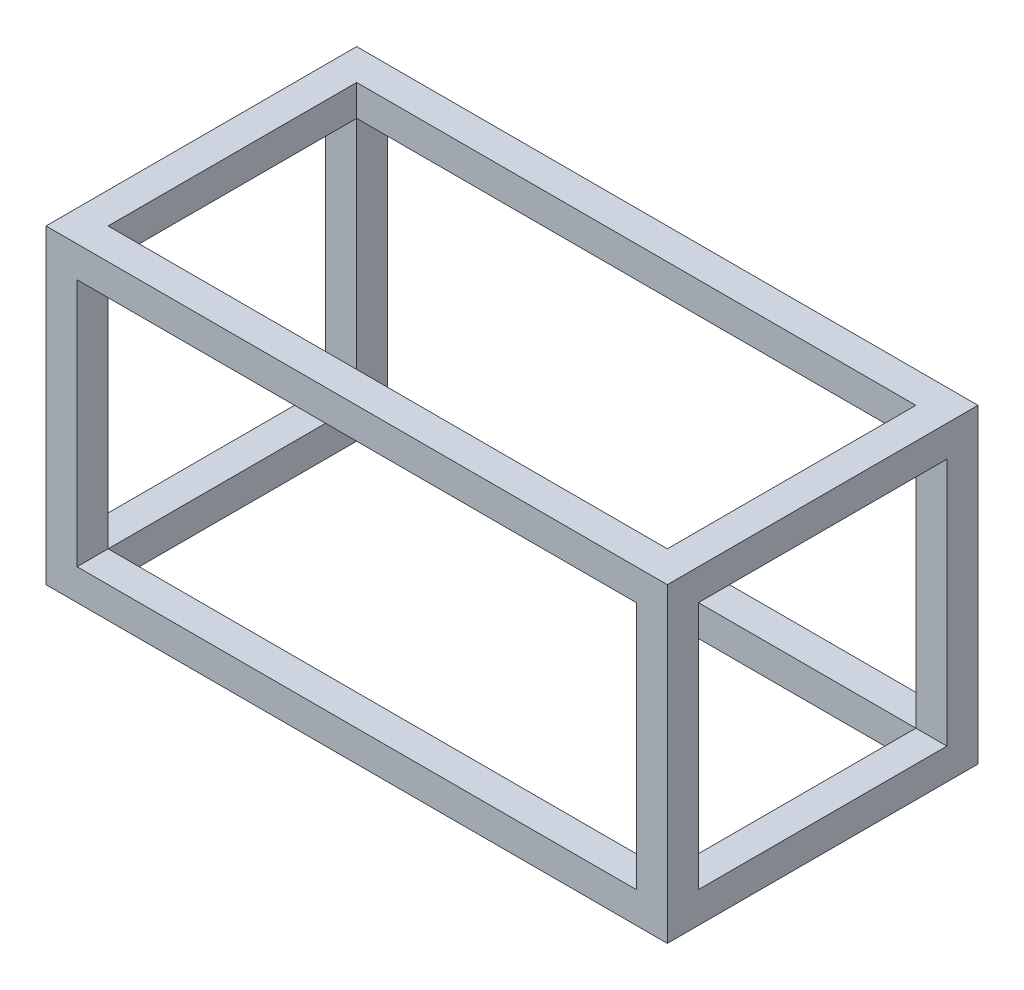
ISO-10303-21;
HEADER;
FILE_DESCRIPTION(('STEP AP214'),'2;1');
FILE_NAME('part.step','',(''),(''),'','','');
FILE_SCHEMA(('AUTOMOTIVE_DESIGN { 1 0 10303 214 1 1 1 1 }'));
ENDSEC;
DATA;
#1=APPLICATION_CONTEXT('core data for automotive mechanical design processes');
#2=APPLICATION_PROTOCOL_DEFINITION('international standard','automotive_design',2000,#1);
#3=PRODUCT_CONTEXT('',#1,'mechanical');
#4=PRODUCT('Part','Part','',(#3));
#5=PRODUCT_RELATED_PRODUCT_CATEGORY('part','',(#4));
#6=PRODUCT_DEFINITION_FORMATION('','',#4);
#7=PRODUCT_DEFINITION_CONTEXT('part definition',#1,'design');
#8=PRODUCT_DEFINITION('design','',#6,#7);
#9=PRODUCT_DEFINITION_SHAPE('','',#8);
#10=(LENGTH_UNIT() NAMED_UNIT(*) SI_UNIT(.MILLI.,.METRE.));
#11=(NAMED_UNIT(*) PLANE_ANGLE_UNIT() SI_UNIT($,.RADIAN.));
#12=(NAMED_UNIT(*) SI_UNIT($,.STERADIAN.) SOLID_ANGLE_UNIT());
#13=UNCERTAINTY_MEASURE_WITH_UNIT(LENGTH_MEASURE(1.E-05),#10,'distance_accuracy_value','');
#14=(GEOMETRIC_REPRESENTATION_CONTEXT(3) GLOBAL_UNCERTAINTY_ASSIGNED_CONTEXT((#13)) GLOBAL_UNIT_ASSIGNED_CONTEXT((#10,
#11,#12)) REPRESENTATION_CONTEXT('',''));
#15=CARTESIAN_POINT('',(0.,0.,0.));
#16=DIRECTION('',(0.,0.,1.));
#17=DIRECTION('',(1.,0.,0.));
#18=AXIS2_PLACEMENT_3D('',#15,#16,#17);
#19=CARTESIAN_POINT('',(5.00000000000001,50.,-5.));
#20=DIRECTION('',(0.,0.,-1.));
#21=DIRECTION('',(-1.,0.,0.));
#22=AXIS2_PLACEMENT_3D('',#19,#20,#21);
#23=PLANE('',#22);
#24=DIRECTION('',(-1.,0.,0.));
#25=VECTOR('',#24,1.);
#26=CARTESIAN_POINT('',(5.00000000000001,5.,-5.));
#27=LINE('',#26,#25);
#28=CARTESIAN_POINT('',(95.,5.,-5.));
#29=VERTEX_POINT('',#28);
#30=CARTESIAN_POINT('',(5.00000000000001,5.,-5.));
#31=VERTEX_POINT('',#30);
#32=EDGE_CURVE('E255',#29,#31,#27,.T.);
#33=ORIENTED_EDGE('',*,*,#32,.F.);
#34=DIRECTION('',(0.,-1.,0.));
#35=VECTOR('',#34,1.);
#36=CARTESIAN_POINT('',(95.,50.,-5.));
#37=LINE('',#36,#35);
#38=CARTESIAN_POINT('',(95.,0.,-5.));
#39=VERTEX_POINT('',#38);
#40=EDGE_CURVE('E363',#29,#39,#37,.T.);
#41=ORIENTED_EDGE('',*,*,#40,.T.);
#42=DIRECTION('',(1.,0.,0.));
#43=VECTOR('',#42,1.);
#44=CARTESIAN_POINT('',(5.00000000000001,0.,-5.));
#45=LINE('',#44,#43);
#46=CARTESIAN_POINT('',(5.00000000000001,0.,-5.));
#47=VERTEX_POINT('',#46);
#48=EDGE_CURVE('E343',#47,#39,#45,.T.);
#49=ORIENTED_EDGE('',*,*,#48,.F.);
#50=DIRECTION('',(0.,-1.,0.));
#51=VECTOR('',#50,1.);
#52=CARTESIAN_POINT('',(5.00000000000001,50.,-5.));
#53=LINE('',#52,#51);
#54=EDGE_CURVE('E368',#31,#47,#53,.T.);
#55=ORIENTED_EDGE('',*,*,#54,.F.);
#56=EDGE_LOOP('',(#33,#41,#49,#55));
#57=FACE_BOUND('',#56,.T.);
#58=ADVANCED_FACE('F43',(#57),#23,.T.);
#59=CARTESIAN_POINT('',(95.,50.,-5.));
#60=VERTEX_POINT('',#59);
#61=CARTESIAN_POINT('',(94.9999999999999,45.,-5.));
#62=VERTEX_POINT('',#61);
#63=EDGE_CURVE('E364',#60,#62,#37,.T.);
#64=ORIENTED_EDGE('',*,*,#63,.T.);
#65=DIRECTION('',(-1.,0.,0.));
#66=VECTOR('',#65,1.);
#67=CARTESIAN_POINT('',(5.00000000000001,45.,-5.));
#68=LINE('',#67,#66);
#69=CARTESIAN_POINT('',(5.,45.,-5.));
#70=VERTEX_POINT('',#69);
#71=EDGE_CURVE('E251',#62,#70,#68,.T.);
#72=ORIENTED_EDGE('',*,*,#71,.T.);
#73=CARTESIAN_POINT('',(5.00000000000001,50.,-5.));
#74=VERTEX_POINT('',#73);
#75=EDGE_CURVE('E369',#74,#70,#53,.T.);
#76=ORIENTED_EDGE('',*,*,#75,.F.);
#77=DIRECTION('',(1.,0.,0.));
#78=VECTOR('',#77,1.);
#79=CARTESIAN_POINT('',(5.00000000000001,50.,-5.));
#80=LINE('',#79,#78);
#81=EDGE_CURVE('E328',#74,#60,#80,.T.);
#82=ORIENTED_EDGE('',*,*,#81,.T.);
#83=EDGE_LOOP('',(#64,#72,#76,#82));
#84=FACE_BOUND('',#83,.T.);
#85=ADVANCED_FACE('F536',(#84),#23,.T.);
#86=DIRECTION('',(1.,0.,0.));
#87=VECTOR('',#86,1.);
#88=CARTESIAN_POINT('',(0.,5.,-5.00000000000001));
#89=LINE('',#88,#87);
#90=CARTESIAN_POINT('',(100.,5.,-5.00000000000001));
#91=VERTEX_POINT('',#90);
#92=EDGE_CURVE('E294',#29,#91,#89,.T.);
#93=ORIENTED_EDGE('',*,*,#92,.F.);
#94=DIRECTION('',(0.,1.,0.));
#95=VECTOR('',#94,1.);
#96=CARTESIAN_POINT('',(95.,50.,-5.));
#97=LINE('',#96,#95);
#98=EDGE_CURVE('E247',#29,#62,#97,.T.);
#99=ORIENTED_EDGE('',*,*,#98,.T.);
#100=DIRECTION('',(1.,0.,0.));
#101=VECTOR('',#100,1.);
#102=CARTESIAN_POINT('',(0.,45.,-5.));
#103=LINE('',#102,#101);
#104=CARTESIAN_POINT('',(100.,45.,-5.));
#105=VERTEX_POINT('',#104);
#106=EDGE_CURVE('E299',#62,#105,#103,.T.);
#107=ORIENTED_EDGE('',*,*,#106,.T.);
#108=DIRECTION('',(0.,-1.,0.));
#109=VECTOR('',#108,1.);
#110=CARTESIAN_POINT('',(100.,45.,-5.));
#111=LINE('',#110,#109);
#112=EDGE_CURVE('E264',#105,#91,#111,.T.);
#113=ORIENTED_EDGE('',*,*,#112,.T.);
#114=EDGE_LOOP('',(#93,#99,#107,#113));
#115=FACE_BOUND('',#114,.T.);
#116=ADVANCED_FACE('F495',(#115),#23,.T.);
#117=CARTESIAN_POINT('',(5.,50.,-45.));
#118=DIRECTION('',(0.,0.,1.));
#119=DIRECTION('',(1.,0.,0.));
#120=AXIS2_PLACEMENT_3D('',#117,#118,#119);
#121=PLANE('',#120);
#122=DIRECTION('',(1.,0.,0.));
#123=VECTOR('',#122,1.);
#124=CARTESIAN_POINT('',(5.,5.,-45.));
#125=LINE('',#124,#123);
#126=CARTESIAN_POINT('',(5.00000000000001,5.,-45.));
#127=VERTEX_POINT('',#126);
#128=CARTESIAN_POINT('',(94.9999999999999,5.,-45.));
#129=VERTEX_POINT('',#128);
#130=EDGE_CURVE('E11',#127,#129,#125,.T.);
#131=ORIENTED_EDGE('',*,*,#130,.F.);
#132=DIRECTION('',(0.,-1.,0.));
#133=VECTOR('',#132,1.);
#134=CARTESIAN_POINT('',(5.,50.,-45.));
#135=LINE('',#134,#133);
#136=CARTESIAN_POINT('',(5.,0.,-45.));
#137=VERTEX_POINT('',#136);
#138=EDGE_CURVE('E339',#127,#137,#135,.T.);
#139=ORIENTED_EDGE('',*,*,#138,.T.);
#140=DIRECTION('',(-1.,0.,0.));
#141=VECTOR('',#140,1.);
#142=CARTESIAN_POINT('',(5.,0.,-45.));
#143=LINE('',#142,#141);
#144=CARTESIAN_POINT('',(95.,0.,-45.));
#145=VERTEX_POINT('',#144);
#146=EDGE_CURVE('E329',#145,#137,#143,.T.);
#147=ORIENTED_EDGE('',*,*,#146,.F.);
#148=DIRECTION('',(0.,-1.,0.));
#149=VECTOR('',#148,1.);
#150=CARTESIAN_POINT('',(95.,50.,-45.));
#151=LINE('',#150,#149);
#152=EDGE_CURVE('E358',#129,#145,#151,.T.);
#153=ORIENTED_EDGE('',*,*,#152,.F.);
#154=EDGE_LOOP('',(#131,#139,#147,#153));
#155=FACE_BOUND('',#154,.T.);
#156=ADVANCED_FACE('F509',(#155),#121,.T.);
#157=CARTESIAN_POINT('',(5.,50.,-45.));
#158=VERTEX_POINT('',#157);
#159=CARTESIAN_POINT('',(5.,45.,-45.));
#160=VERTEX_POINT('',#159);
#161=EDGE_CURVE('E354',#158,#160,#135,.T.);
#162=ORIENTED_EDGE('',*,*,#161,.T.);
#163=DIRECTION('',(1.,0.,0.));
#164=VECTOR('',#163,1.);
#165=CARTESIAN_POINT('',(5.,45.,-45.));
#166=LINE('',#165,#164);
#167=CARTESIAN_POINT('',(95.,45.,-45.));
#168=VERTEX_POINT('',#167);
#169=EDGE_CURVE('E52',#160,#168,#166,.T.);
#170=ORIENTED_EDGE('',*,*,#169,.T.);
#171=CARTESIAN_POINT('',(95.,50.,-45.));
#172=VERTEX_POINT('',#171);
#173=EDGE_CURVE('E359',#172,#168,#151,.T.);
#174=ORIENTED_EDGE('',*,*,#173,.F.);
#175=DIRECTION('',(-1.,0.,0.));
#176=VECTOR('',#175,1.);
#177=CARTESIAN_POINT('',(5.,50.,-45.));
#178=LINE('',#177,#176);
#179=EDGE_CURVE('E336',#172,#158,#178,.T.);
#180=ORIENTED_EDGE('',*,*,#179,.T.);
#181=EDGE_LOOP('',(#162,#170,#174,#180));
#182=FACE_BOUND('',#181,.T.);
#183=ADVANCED_FACE('F418',(#182),#121,.T.);
#184=DIRECTION('',(1.,0.,0.));
#185=VECTOR('',#184,1.);
#186=CARTESIAN_POINT('',(0.,45.,-45.));
#187=LINE('',#186,#185);
#188=CARTESIAN_POINT('',(100.,45.,-45.));
#189=VERTEX_POINT('',#188);
#190=EDGE_CURVE('E304',#168,#189,#187,.T.);
#191=ORIENTED_EDGE('',*,*,#190,.F.);
#192=DIRECTION('',(0.,-1.,0.));
#193=VECTOR('',#192,1.);
#194=CARTESIAN_POINT('',(95.,50.,-45.));
#195=LINE('',#194,#193);
#196=EDGE_CURVE('E244',#168,#129,#195,.T.);
#197=ORIENTED_EDGE('',*,*,#196,.T.);
#198=DIRECTION('',(1.,0.,0.));
#199=VECTOR('',#198,1.);
#200=CARTESIAN_POINT('',(0.,5.,-45.));
#201=LINE('',#200,#199);
#202=CARTESIAN_POINT('',(100.,5.,-45.));
#203=VERTEX_POINT('',#202);
#204=EDGE_CURVE('E275',#129,#203,#201,.T.);
#205=ORIENTED_EDGE('',*,*,#204,.T.);
#206=DIRECTION('',(0.,-1.,0.));
#207=VECTOR('',#206,1.);
#208=CARTESIAN_POINT('',(100.,45.,-45.));
#209=LINE('',#208,#207);
#210=EDGE_CURVE('E278',#189,#203,#209,.T.);
#211=ORIENTED_EDGE('',*,*,#210,.F.);
#212=EDGE_LOOP('',(#191,#197,#205,#211));
#213=FACE_BOUND('',#212,.T.);
#214=ADVANCED_FACE('F424',(#213),#121,.T.);
#215=CARTESIAN_POINT('',(5.,50.,-45.));
#216=DIRECTION('',(1.,0.,0.));
#217=DIRECTION('',(0.,0.,-1.));
#218=AXIS2_PLACEMENT_3D('',#215,#216,#217);
#219=PLANE('',#218);
#220=ORIENTED_EDGE('',*,*,#75,.T.);
#221=DIRECTION('',(0.,0.,-1.));
#222=VECTOR('',#221,1.);
#223=CARTESIAN_POINT('',(5.,45.,-45.));
#224=LINE('',#223,#222);
#225=EDGE_CURVE('E312',#70,#160,#224,.T.);
#226=ORIENTED_EDGE('',*,*,#225,.T.);
#227=ORIENTED_EDGE('',*,*,#161,.F.);
#228=DIRECTION('',(0.,0.,1.));
#229=VECTOR('',#228,1.);
#230=CARTESIAN_POINT('',(5.,50.,-45.));
#231=LINE('',#230,#229);
#232=EDGE_CURVE('E325',#158,#74,#231,.T.);
#233=ORIENTED_EDGE('',*,*,#232,.T.);
#234=EDGE_LOOP('',(#220,#226,#227,#233));
#235=FACE_BOUND('',#234,.T.);
#236=ADVANCED_FACE('F442',(#235),#219,.T.);
#237=CARTESIAN_POINT('',(95.,50.,-45.));
#238=DIRECTION('',(-1.,0.,0.));
#239=DIRECTION('',(0.,0.,1.));
#240=AXIS2_PLACEMENT_3D('',#237,#238,#239);
#241=PLANE('',#240);
#242=ORIENTED_EDGE('',*,*,#173,.T.);
#243=DIRECTION('',(0.,0.,1.));
#244=VECTOR('',#243,1.);
#245=CARTESIAN_POINT('',(95.,45.,-45.));
#246=LINE('',#245,#244);
#247=EDGE_CURVE('E293',#168,#62,#246,.T.);
#248=ORIENTED_EDGE('',*,*,#247,.T.);
#249=ORIENTED_EDGE('',*,*,#63,.F.);
#250=DIRECTION('',(0.,0.,-1.));
#251=VECTOR('',#250,1.);
#252=CARTESIAN_POINT('',(95.,50.,-45.));
#253=LINE('',#252,#251);
#254=EDGE_CURVE('E332',#60,#172,#253,.T.);
#255=ORIENTED_EDGE('',*,*,#254,.T.);
#256=EDGE_LOOP('',(#242,#248,#249,#255));
#257=FACE_BOUND('',#256,.T.);
#258=ADVANCED_FACE('F434',(#257),#241,.T.);
#259=CARTESIAN_POINT('',(0.,50.,0.));
#260=DIRECTION('',(0.,-1.,0.));
#261=DIRECTION('',(0.,0.,-1.));
#262=AXIS2_PLACEMENT_3D('',#259,#260,#261);
#263=PLANE('',#262);
#264=DIRECTION('',(0.,0.,1.));
#265=VECTOR('',#264,1.);
#266=CARTESIAN_POINT('',(0.,50.,0.));
#267=LINE('',#266,#265);
#268=CARTESIAN_POINT('',(0.,50.,-50.));
#269=VERTEX_POINT('',#268);
#270=CARTESIAN_POINT('',(0.,50.,0.));
#271=VERTEX_POINT('',#270);
#272=EDGE_CURVE('E374',#269,#271,#267,.T.);
#273=ORIENTED_EDGE('',*,*,#272,.T.);
#274=DIRECTION('',(1.,0.,0.));
#275=VECTOR('',#274,1.);
#276=CARTESIAN_POINT('',(0.,50.,0.));
#277=LINE('',#276,#275);
#278=CARTESIAN_POINT('',(100.,50.,0.));
#279=VERTEX_POINT('',#278);
#280=EDGE_CURVE('E378',#271,#279,#277,.T.);
#281=ORIENTED_EDGE('',*,*,#280,.T.);
#282=DIRECTION('',(0.,0.,-1.));
#283=VECTOR('',#282,1.);
#284=CARTESIAN_POINT('',(100.,50.,0.));
#285=LINE('',#284,#283);
#286=CARTESIAN_POINT('',(100.,50.,-50.));
#287=VERTEX_POINT('',#286);
#288=EDGE_CURVE('E382',#279,#287,#285,.T.);
#289=ORIENTED_EDGE('',*,*,#288,.T.);
#290=DIRECTION('',(-1.,0.,0.));
#291=VECTOR('',#290,1.);
#292=CARTESIAN_POINT('',(0.,50.,-50.));
#293=LINE('',#292,#291);
#294=EDGE_CURVE('E385',#287,#269,#293,.T.);
#295=ORIENTED_EDGE('',*,*,#294,.T.);
#296=EDGE_LOOP('',(#273,#281,#289,#295));
#297=FACE_BOUND('',#296,.T.);
#298=ORIENTED_EDGE('',*,*,#232,.F.);
#299=ORIENTED_EDGE('',*,*,#179,.F.);
#300=ORIENTED_EDGE('',*,*,#254,.F.);
#301=ORIENTED_EDGE('',*,*,#81,.F.);
#302=EDGE_LOOP('',(#298,#299,#300,#301));
#303=FACE_BOUND('',#302,.T.);
#304=ADVANCED_FACE('F440',(#297,#303),#263,.F.);
#305=CARTESIAN_POINT('',(0.,0.,0.));
#306=DIRECTION('',(0.,-1.,0.));
#307=DIRECTION('',(0.,0.,-1.));
#308=AXIS2_PLACEMENT_3D('',#305,#306,#307);
#309=PLANE('',#308);
#310=DIRECTION('',(0.,0.,1.));
#311=VECTOR('',#310,1.);
#312=CARTESIAN_POINT('',(0.,0.,0.));
#313=LINE('',#312,#311);
#314=CARTESIAN_POINT('',(0.,0.,-50.));
#315=VERTEX_POINT('',#314);
#316=CARTESIAN_POINT('',(0.,0.,0.));
#317=VERTEX_POINT('',#316);
#318=EDGE_CURVE('E373',#315,#317,#313,.T.);
#319=ORIENTED_EDGE('',*,*,#318,.F.);
#320=DIRECTION('',(-1.,0.,0.));
#321=VECTOR('',#320,1.);
#322=CARTESIAN_POINT('',(0.,0.,-50.));
#323=LINE('',#322,#321);
#324=CARTESIAN_POINT('',(100.,0.,-50.));
#325=VERTEX_POINT('',#324);
#326=EDGE_CURVE('E379',#325,#315,#323,.T.);
#327=ORIENTED_EDGE('',*,*,#326,.F.);
#328=DIRECTION('',(0.,0.,-1.));
#329=VECTOR('',#328,1.);
#330=CARTESIAN_POINT('',(100.,0.,0.));
#331=LINE('',#330,#329);
#332=CARTESIAN_POINT('',(100.,0.,0.));
#333=VERTEX_POINT('',#332);
#334=EDGE_CURVE('E395',#333,#325,#331,.T.);
#335=ORIENTED_EDGE('',*,*,#334,.F.);
#336=DIRECTION('',(1.,0.,0.));
#337=VECTOR('',#336,1.);
#338=CARTESIAN_POINT('',(0.,0.,0.));
#339=LINE('',#338,#337);
#340=EDGE_CURVE('E392',#317,#333,#339,.T.);
#341=ORIENTED_EDGE('',*,*,#340,.F.);
#342=EDGE_LOOP('',(#319,#327,#335,#341));
#343=FACE_BOUND('',#342,.T.);
#344=ORIENTED_EDGE('',*,*,#146,.T.);
#345=DIRECTION('',(0.,0.,1.));
#346=VECTOR('',#345,1.);
#347=CARTESIAN_POINT('',(5.,0.,-45.));
#348=LINE('',#347,#346);
#349=EDGE_CURVE('E324',#137,#47,#348,.T.);
#350=ORIENTED_EDGE('',*,*,#349,.T.);
#351=ORIENTED_EDGE('',*,*,#48,.T.);
#352=DIRECTION('',(0.,0.,-1.));
#353=VECTOR('',#352,1.);
#354=CARTESIAN_POINT('',(95.,0.,-45.));
#355=LINE('',#354,#353);
#356=EDGE_CURVE('E347',#39,#145,#355,.T.);
#357=ORIENTED_EDGE('',*,*,#356,.T.);
#358=EDGE_LOOP('',(#344,#350,#351,#357));
#359=FACE_BOUND('',#358,.T.);
#360=ADVANCED_FACE('F511',(#343,#359),#309,.T.);
#361=CARTESIAN_POINT('',(0.,50.,0.));
#362=DIRECTION('',(1.,0.,0.));
#363=DIRECTION('',(0.,0.,-1.));
#364=AXIS2_PLACEMENT_3D('',#361,#362,#363);
#365=PLANE('',#364);
#366=DIRECTION('',(0.,-1.,0.));
#367=VECTOR('',#366,1.);
#368=CARTESIAN_POINT('',(0.,45.,-5.));
#369=LINE('',#368,#367);
#370=CARTESIAN_POINT('',(0.,45.,-5.));
#371=VERTEX_POINT('',#370);
#372=CARTESIAN_POINT('',(0.,5.,-5.00000000000001));
#373=VERTEX_POINT('',#372);
#374=EDGE_CURVE('E271',#371,#373,#369,.T.);
#375=ORIENTED_EDGE('',*,*,#374,.T.);
#376=DIRECTION('',(0.,0.,-1.));
#377=VECTOR('',#376,1.);
#378=CARTESIAN_POINT('',(0.,5.,-5.00000000000001));
#379=LINE('',#378,#377);
#380=CARTESIAN_POINT('',(0.,5.,-45.));
#381=VERTEX_POINT('',#380);
#382=EDGE_CURVE('E259',#373,#381,#379,.T.);
#383=ORIENTED_EDGE('',*,*,#382,.T.);
#384=DIRECTION('',(0.,-1.,0.));
#385=VECTOR('',#384,1.);
#386=CARTESIAN_POINT('',(0.,45.,-45.));
#387=LINE('',#386,#385);
#388=CARTESIAN_POINT('',(0.,45.,-45.));
#389=VERTEX_POINT('',#388);
#390=EDGE_CURVE('E263',#389,#381,#387,.T.);
#391=ORIENTED_EDGE('',*,*,#390,.F.);
#392=DIRECTION('',(0.,0.,-1.));
#393=VECTOR('',#392,1.);
#394=CARTESIAN_POINT('',(0.,45.,-5.));
#395=LINE('',#394,#393);
#396=EDGE_CURVE('E267',#371,#389,#395,.T.);
#397=ORIENTED_EDGE('',*,*,#396,.F.);
#398=EDGE_LOOP('',(#375,#383,#391,#397));
#399=FACE_BOUND('',#398,.T.);
#400=ORIENTED_EDGE('',*,*,#318,.T.);
#401=DIRECTION('',(0.,-1.,0.));
#402=VECTOR('',#401,1.);
#403=CARTESIAN_POINT('',(0.,50.,0.));
#404=LINE('',#403,#402);
#405=EDGE_CURVE('E411',#271,#317,#404,.T.);
#406=ORIENTED_EDGE('',*,*,#405,.F.);
#407=ORIENTED_EDGE('',*,*,#272,.F.);
#408=DIRECTION('',(0.,-1.,0.));
#409=VECTOR('',#408,1.);
#410=CARTESIAN_POINT('',(0.,50.,-50.));
#411=LINE('',#410,#409);
#412=EDGE_CURVE('E388',#269,#315,#411,.T.);
#413=ORIENTED_EDGE('',*,*,#412,.T.);
#414=EDGE_LOOP('',(#400,#406,#407,#413));
#415=FACE_BOUND('',#414,.T.);
#416=ADVANCED_FACE('F45',(#399,#415),#365,.F.);
#417=CARTESIAN_POINT('',(0.,50.,0.));
#418=DIRECTION('',(0.,0.,-1.));
#419=DIRECTION('',(-1.,0.,0.));
#420=AXIS2_PLACEMENT_3D('',#417,#418,#419);
#421=PLANE('',#420);
#422=DIRECTION('',(0.,-1.,0.));
#423=VECTOR('',#422,1.);
#424=CARTESIAN_POINT('',(95.,45.,0.));
#425=LINE('',#424,#423);
#426=CARTESIAN_POINT('',(95.,45.,0.));
#427=VERTEX_POINT('',#426);
#428=CARTESIAN_POINT('',(95.,5.,0.));
#429=VERTEX_POINT('',#428);
#430=EDGE_CURVE('E220',#427,#429,#425,.T.);
#431=ORIENTED_EDGE('',*,*,#430,.T.);
#432=DIRECTION('',(1.,0.,0.));
#433=VECTOR('',#432,1.);
#434=CARTESIAN_POINT('',(5.00000000000001,5.,0.));
#435=LINE('',#434,#433);
#436=CARTESIAN_POINT('',(5.00000000000001,5.,0.));
#437=VERTEX_POINT('',#436);
#438=EDGE_CURVE('E59',#437,#429,#435,.T.);
#439=ORIENTED_EDGE('',*,*,#438,.F.);
#440=DIRECTION('',(0.,-1.,0.));
#441=VECTOR('',#440,1.);
#442=CARTESIAN_POINT('',(5.,45.,0.));
#443=LINE('',#442,#441);
#444=CARTESIAN_POINT('',(5.,45.,0.));
#445=VERTEX_POINT('',#444);
#446=EDGE_CURVE('E207',#445,#437,#443,.T.);
#447=ORIENTED_EDGE('',*,*,#446,.F.);
#448=DIRECTION('',(1.,0.,0.));
#449=VECTOR('',#448,1.);
#450=CARTESIAN_POINT('',(5.,45.,0.));
#451=LINE('',#450,#449);
#452=EDGE_CURVE('E211',#445,#427,#451,.T.);
#453=ORIENTED_EDGE('',*,*,#452,.T.);
#454=EDGE_LOOP('',(#431,#439,#447,#453));
#455=FACE_BOUND('',#454,.T.);
#456=ORIENTED_EDGE('',*,*,#340,.T.);
#457=DIRECTION('',(0.,-1.,0.));
#458=VECTOR('',#457,1.);
#459=CARTESIAN_POINT('',(100.,50.,0.));
#460=LINE('',#459,#458);
#461=EDGE_CURVE('E407',#279,#333,#460,.T.);
#462=ORIENTED_EDGE('',*,*,#461,.F.);
#463=ORIENTED_EDGE('',*,*,#280,.F.);
#464=ORIENTED_EDGE('',*,*,#405,.T.);
#465=EDGE_LOOP('',(#456,#462,#463,#464));
#466=FACE_BOUND('',#465,.T.);
#467=ADVANCED_FACE('F484',(#455,#466),#421,.F.);
#468=CARTESIAN_POINT('',(100.,50.,0.));
#469=DIRECTION('',(-1.,0.,0.));
#470=DIRECTION('',(0.,0.,1.));
#471=AXIS2_PLACEMENT_3D('',#468,#469,#470);
#472=PLANE('',#471);
#473=ORIENTED_EDGE('',*,*,#210,.T.);
#474=DIRECTION('',(0.,0.,-1.));
#475=VECTOR('',#474,1.);
#476=CARTESIAN_POINT('',(100.,5.,-5.00000000000001));
#477=LINE('',#476,#475);
#478=EDGE_CURVE('E258',#91,#203,#477,.T.);
#479=ORIENTED_EDGE('',*,*,#478,.F.);
#480=ORIENTED_EDGE('',*,*,#112,.F.);
#481=DIRECTION('',(0.,0.,-1.));
#482=VECTOR('',#481,1.);
#483=CARTESIAN_POINT('',(100.,45.,-5.));
#484=LINE('',#483,#482);
#485=EDGE_CURVE('E282',#105,#189,#484,.T.);
#486=ORIENTED_EDGE('',*,*,#485,.T.);
#487=EDGE_LOOP('',(#473,#479,#480,#486));
#488=FACE_BOUND('',#487,.T.);
#489=ORIENTED_EDGE('',*,*,#334,.T.);
#490=DIRECTION('',(0.,-1.,0.));
#491=VECTOR('',#490,1.);
#492=CARTESIAN_POINT('',(100.,50.,-50.));
#493=LINE('',#492,#491);
#494=EDGE_CURVE('E403',#287,#325,#493,.T.);
#495=ORIENTED_EDGE('',*,*,#494,.F.);
#496=ORIENTED_EDGE('',*,*,#288,.F.);
#497=ORIENTED_EDGE('',*,*,#461,.T.);
#498=EDGE_LOOP('',(#489,#495,#496,#497));
#499=FACE_BOUND('',#498,.T.);
#500=ADVANCED_FACE('F515',(#488,#499),#472,.F.);
#501=CARTESIAN_POINT('',(0.,50.,-50.));
#502=DIRECTION('',(0.,0.,1.));
#503=DIRECTION('',(1.,0.,0.));
#504=AXIS2_PLACEMENT_3D('',#501,#502,#503);
#505=PLANE('',#504);
#506=DIRECTION('',(0.,-1.,0.));
#507=VECTOR('',#506,1.);
#508=CARTESIAN_POINT('',(5.,45.,-50.));
#509=LINE('',#508,#507);
#510=CARTESIAN_POINT('',(5.,45.,-50.));
#511=VERTEX_POINT('',#510);
#512=CARTESIAN_POINT('',(5.00000000000001,5.,-50.));
#513=VERTEX_POINT('',#512);
#514=EDGE_CURVE('E205',#511,#513,#509,.T.);
#515=ORIENTED_EDGE('',*,*,#514,.T.);
#516=DIRECTION('',(1.,0.,0.));
#517=VECTOR('',#516,1.);
#518=CARTESIAN_POINT('',(5.00000000000001,5.,-50.));
#519=LINE('',#518,#517);
#520=CARTESIAN_POINT('',(95.,5.,-50.));
#521=VERTEX_POINT('',#520);
#522=EDGE_CURVE('E189',#513,#521,#519,.T.);
#523=ORIENTED_EDGE('',*,*,#522,.T.);
#524=DIRECTION('',(0.,-1.,0.));
#525=VECTOR('',#524,1.);
#526=CARTESIAN_POINT('',(95.,45.,-50.));
#527=LINE('',#526,#525);
#528=CARTESIAN_POINT('',(95.,45.,-50.));
#529=VERTEX_POINT('',#528);
#530=EDGE_CURVE('E180',#529,#521,#527,.T.);
#531=ORIENTED_EDGE('',*,*,#530,.F.);
#532=DIRECTION('',(1.,0.,0.));
#533=VECTOR('',#532,1.);
#534=CARTESIAN_POINT('',(5.,45.,-50.));
#535=LINE('',#534,#533);
#536=EDGE_CURVE('E188',#511,#529,#535,.T.);
#537=ORIENTED_EDGE('',*,*,#536,.F.);
#538=EDGE_LOOP('',(#515,#523,#531,#537));
#539=FACE_BOUND('',#538,.T.);
#540=ORIENTED_EDGE('',*,*,#326,.T.);
#541=ORIENTED_EDGE('',*,*,#412,.F.);
#542=ORIENTED_EDGE('',*,*,#294,.F.);
#543=ORIENTED_EDGE('',*,*,#494,.T.);
#544=EDGE_LOOP('',(#540,#541,#542,#543));
#545=FACE_BOUND('',#544,.T.);
#546=ADVANCED_FACE('F202',(#539,#545),#505,.F.);
#547=DIRECTION('',(0.,0.,-1.));
#548=VECTOR('',#547,1.);
#549=CARTESIAN_POINT('',(5.,5.,-45.));
#550=LINE('',#549,#548);
#551=EDGE_CURVE('E320',#31,#127,#550,.T.);
#552=ORIENTED_EDGE('',*,*,#551,.F.);
#553=ORIENTED_EDGE('',*,*,#54,.T.);
#554=ORIENTED_EDGE('',*,*,#349,.F.);
#555=ORIENTED_EDGE('',*,*,#138,.F.);
#556=EDGE_LOOP('',(#552,#553,#554,#555));
#557=FACE_BOUND('',#556,.T.);
#558=ADVANCED_FACE('F467',(#557),#219,.T.);
#559=DIRECTION('',(0.,1.,0.));
#560=VECTOR('',#559,1.);
#561=CARTESIAN_POINT('',(5.,50.,-5.));
#562=LINE('',#561,#560);
#563=EDGE_CURVE('E241',#31,#70,#562,.T.);
#564=ORIENTED_EDGE('',*,*,#563,.F.);
#565=EDGE_CURVE('E289',#373,#31,#89,.T.);
#566=ORIENTED_EDGE('',*,*,#565,.F.);
#567=ORIENTED_EDGE('',*,*,#374,.F.);
#568=EDGE_CURVE('E295',#371,#70,#103,.T.);
#569=ORIENTED_EDGE('',*,*,#568,.T.);
#570=EDGE_LOOP('',(#564,#566,#567,#569));
#571=FACE_BOUND('',#570,.T.);
#572=ADVANCED_FACE('F450',(#571),#23,.T.);
#573=DIRECTION('',(0.,0.,1.));
#574=VECTOR('',#573,1.);
#575=CARTESIAN_POINT('',(95.,5.,-45.));
#576=LINE('',#575,#574);
#577=EDGE_CURVE('E316',#129,#29,#576,.T.);
#578=ORIENTED_EDGE('',*,*,#577,.F.);
#579=ORIENTED_EDGE('',*,*,#152,.T.);
#580=ORIENTED_EDGE('',*,*,#356,.F.);
#581=ORIENTED_EDGE('',*,*,#40,.F.);
#582=EDGE_LOOP('',(#578,#579,#580,#581));
#583=FACE_BOUND('',#582,.T.);
#584=ADVANCED_FACE('F503',(#583),#241,.T.);
#585=DIRECTION('',(0.,-1.,0.));
#586=VECTOR('',#585,1.);
#587=CARTESIAN_POINT('',(5.,50.,-45.));
#588=LINE('',#587,#586);
#589=EDGE_CURVE('E230',#160,#127,#588,.T.);
#590=ORIENTED_EDGE('',*,*,#589,.F.);
#591=EDGE_CURVE('E300',#389,#160,#187,.T.);
#592=ORIENTED_EDGE('',*,*,#591,.F.);
#593=ORIENTED_EDGE('',*,*,#390,.T.);
#594=EDGE_CURVE('E305',#381,#127,#201,.T.);
#595=ORIENTED_EDGE('',*,*,#594,.T.);
#596=EDGE_LOOP('',(#590,#592,#593,#595));
#597=FACE_BOUND('',#596,.T.);
#598=ADVANCED_FACE('F459',(#597),#121,.T.);
#599=CARTESIAN_POINT('',(0.,45.,-5.));
#600=DIRECTION('',(0.,-1.,0.));
#601=DIRECTION('',(0.,0.,-1.));
#602=AXIS2_PLACEMENT_3D('',#599,#600,#601);
#603=PLANE('',#602);
#604=ORIENTED_EDGE('',*,*,#190,.T.);
#605=ORIENTED_EDGE('',*,*,#485,.F.);
#606=ORIENTED_EDGE('',*,*,#106,.F.);
#607=ORIENTED_EDGE('',*,*,#247,.F.);
#608=EDGE_LOOP('',(#604,#605,#606,#607));
#609=FACE_BOUND('',#608,.T.);
#610=ADVANCED_FACE('F431',(#609),#603,.T.);
#611=CARTESIAN_POINT('',(0.,5.,-5.00000000000001));
#612=DIRECTION('',(0.,-1.,0.));
#613=DIRECTION('',(0.,0.,-1.));
#614=AXIS2_PLACEMENT_3D('',#611,#612,#613);
#615=PLANE('',#614);
#616=ORIENTED_EDGE('',*,*,#577,.T.);
#617=ORIENTED_EDGE('',*,*,#92,.T.);
#618=ORIENTED_EDGE('',*,*,#478,.T.);
#619=ORIENTED_EDGE('',*,*,#204,.F.);
#620=EDGE_LOOP('',(#616,#617,#618,#619));
#621=FACE_BOUND('',#620,.T.);
#622=ADVANCED_FACE('F513',(#621),#615,.F.);
#623=ORIENTED_EDGE('',*,*,#551,.T.);
#624=ORIENTED_EDGE('',*,*,#594,.F.);
#625=ORIENTED_EDGE('',*,*,#382,.F.);
#626=ORIENTED_EDGE('',*,*,#565,.T.);
#627=EDGE_LOOP('',(#623,#624,#625,#626));
#628=FACE_BOUND('',#627,.T.);
#629=ADVANCED_FACE('F461',(#628),#615,.F.);
#630=ORIENTED_EDGE('',*,*,#568,.F.);
#631=ORIENTED_EDGE('',*,*,#396,.T.);
#632=ORIENTED_EDGE('',*,*,#591,.T.);
#633=ORIENTED_EDGE('',*,*,#225,.F.);
#634=EDGE_LOOP('',(#630,#631,#632,#633));
#635=FACE_BOUND('',#634,.T.);
#636=ADVANCED_FACE('F446',(#635),#603,.T.);
#637=CARTESIAN_POINT('',(95.,45.,-50.));
#638=DIRECTION('',(-1.,0.,0.));
#639=DIRECTION('',(0.,0.,1.));
#640=AXIS2_PLACEMENT_3D('',#637,#638,#639);
#641=PLANE('',#640);
#642=DIRECTION('',(0.,0.,1.));
#643=VECTOR('',#642,1.);
#644=CARTESIAN_POINT('',(95.,45.,-50.));
#645=LINE('',#644,#643);
#646=EDGE_CURVE('E67',#529,#168,#645,.T.);
#647=ORIENTED_EDGE('',*,*,#646,.F.);
#648=ORIENTED_EDGE('',*,*,#530,.T.);
#649=DIRECTION('',(0.,0.,1.));
#650=VECTOR('',#649,1.);
#651=CARTESIAN_POINT('',(95.,5.,-50.));
#652=LINE('',#651,#650);
#653=EDGE_CURVE('E183',#521,#129,#652,.T.);
#654=ORIENTED_EDGE('',*,*,#653,.T.);
#655=ORIENTED_EDGE('',*,*,#196,.F.);
#656=EDGE_LOOP('',(#647,#648,#654,#655));
#657=FACE_BOUND('',#656,.T.);
#658=ADVANCED_FACE('F182',(#657),#641,.T.);
#659=CARTESIAN_POINT('',(5.,45.,-50.));
#660=DIRECTION('',(0.,-1.,0.));
#661=DIRECTION('',(0.,0.,-1.));
#662=AXIS2_PLACEMENT_3D('',#659,#660,#661);
#663=PLANE('',#662);
#664=DIRECTION('',(0.,0.,1.));
#665=VECTOR('',#664,1.);
#666=CARTESIAN_POINT('',(5.,45.,-50.));
#667=LINE('',#666,#665);
#668=EDGE_CURVE('E232',#511,#160,#667,.T.);
#669=ORIENTED_EDGE('',*,*,#668,.F.);
#670=ORIENTED_EDGE('',*,*,#536,.T.);
#671=ORIENTED_EDGE('',*,*,#646,.T.);
#672=ORIENTED_EDGE('',*,*,#169,.F.);
#673=EDGE_LOOP('',(#669,#670,#671,#672));
#674=FACE_BOUND('',#673,.T.);
#675=ADVANCED_FACE('F643',(#674),#663,.T.);
#676=CARTESIAN_POINT('',(5.,45.,-50.));
#677=DIRECTION('',(-1.,0.,0.));
#678=DIRECTION('',(0.,-1.,0.));
#679=AXIS2_PLACEMENT_3D('',#676,#677,#678);
#680=PLANE('',#679);
#681=ORIENTED_EDGE('',*,*,#589,.T.);
#682=DIRECTION('',(0.,0.,1.));
#683=VECTOR('',#682,1.);
#684=CARTESIAN_POINT('',(5.00000000000001,5.,-50.));
#685=LINE('',#684,#683);
#686=EDGE_CURVE('E227',#513,#127,#685,.T.);
#687=ORIENTED_EDGE('',*,*,#686,.F.);
#688=ORIENTED_EDGE('',*,*,#514,.F.);
#689=ORIENTED_EDGE('',*,*,#668,.T.);
#690=EDGE_LOOP('',(#681,#687,#688,#689));
#691=FACE_BOUND('',#690,.T.);
#692=ADVANCED_FACE('F654',(#691),#680,.F.);
#693=CARTESIAN_POINT('',(5.00000000000001,5.,-50.));
#694=DIRECTION('',(0.,-1.,0.));
#695=DIRECTION('',(0.,0.,-1.));
#696=AXIS2_PLACEMENT_3D('',#693,#694,#695);
#697=PLANE('',#696);
#698=ORIENTED_EDGE('',*,*,#130,.T.);
#699=ORIENTED_EDGE('',*,*,#653,.F.);
#700=ORIENTED_EDGE('',*,*,#522,.F.);
#701=ORIENTED_EDGE('',*,*,#686,.T.);
#702=EDGE_LOOP('',(#698,#699,#700,#701));
#703=FACE_BOUND('',#702,.T.);
#704=ADVANCED_FACE('F193',(#703),#697,.F.);
#705=ORIENTED_EDGE('',*,*,#32,.T.);
#706=EDGE_CURVE('E231',#31,#437,#685,.T.);
#707=ORIENTED_EDGE('',*,*,#706,.T.);
#708=ORIENTED_EDGE('',*,*,#438,.T.);
#709=EDGE_CURVE('E200',#29,#429,#652,.T.);
#710=ORIENTED_EDGE('',*,*,#709,.F.);
#711=EDGE_LOOP('',(#705,#707,#708,#710));
#712=FACE_BOUND('',#711,.T.);
#713=ADVANCED_FACE('F675',(#712),#697,.F.);
#714=EDGE_CURVE('E199',#62,#427,#645,.T.);
#715=ORIENTED_EDGE('',*,*,#714,.T.);
#716=ORIENTED_EDGE('',*,*,#452,.F.);
#717=EDGE_CURVE('E236',#70,#445,#667,.T.);
#718=ORIENTED_EDGE('',*,*,#717,.F.);
#719=ORIENTED_EDGE('',*,*,#71,.F.);
#720=EDGE_LOOP('',(#715,#716,#718,#719));
#721=FACE_BOUND('',#720,.T.);
#722=ADVANCED_FACE('F490',(#721),#663,.T.);
#723=ORIENTED_EDGE('',*,*,#709,.T.);
#724=ORIENTED_EDGE('',*,*,#430,.F.);
#725=ORIENTED_EDGE('',*,*,#714,.F.);
#726=ORIENTED_EDGE('',*,*,#98,.F.);
#727=EDGE_LOOP('',(#723,#724,#725,#726));
#728=FACE_BOUND('',#727,.T.);
#729=ADVANCED_FACE('F481',(#728),#641,.T.);
#730=ORIENTED_EDGE('',*,*,#563,.T.);
#731=ORIENTED_EDGE('',*,*,#717,.T.);
#732=ORIENTED_EDGE('',*,*,#446,.T.);
#733=ORIENTED_EDGE('',*,*,#706,.F.);
#734=EDGE_LOOP('',(#730,#731,#732,#733));
#735=FACE_BOUND('',#734,.T.);
#736=ADVANCED_FACE('F666',(#735),#680,.F.);
#737=CLOSED_SHELL('',(#58,#85,#116,#156,#183,#214,#236,#258,#304,#360,#416,#467,#500,#546,#558,
#572,#584,#598,#610,#622,#629,#636,#658,#675,#692,#704,#713,#722,#729,#736));
#738=MANIFOLD_SOLID_BREP('B2',#737);
#739=ADVANCED_BREP_SHAPE_REPRESENTATION('',(#18,#738),#14);
#740=SHAPE_DEFINITION_REPRESENTATION(#9,#739);
ENDSEC;
END-ISO-10303-21;
